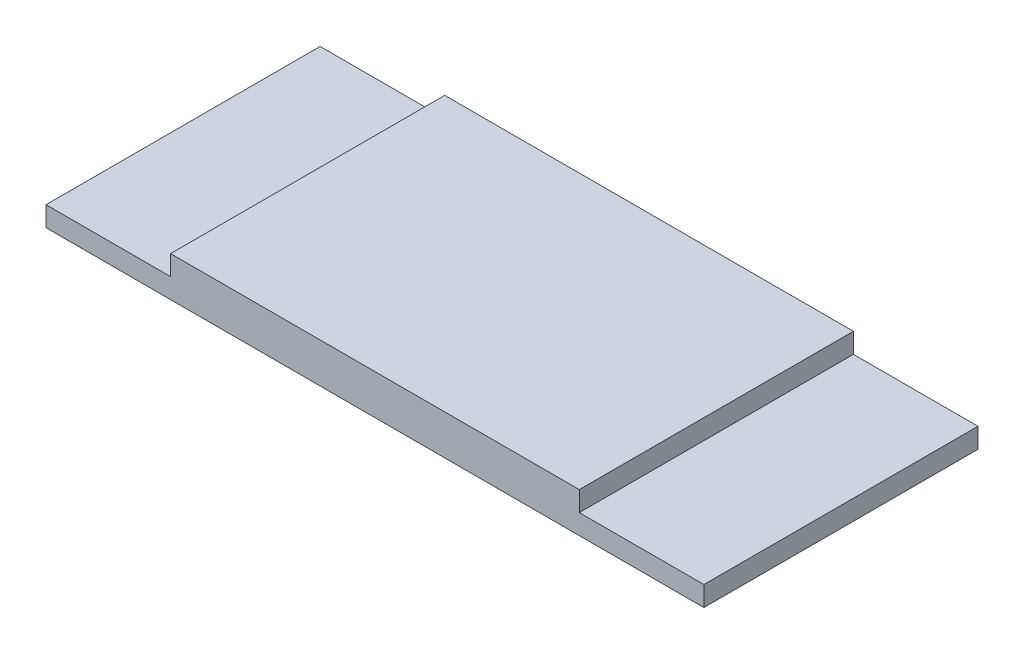
ISO-10303-21;
HEADER;
FILE_DESCRIPTION(('STEP AP214'),'2;1');
FILE_NAME('part.step','',(''),(''),'','','');
FILE_SCHEMA(('AUTOMOTIVE_DESIGN { 1 0 10303 214 1 1 1 1 }'));
ENDSEC;
DATA;
#1=APPLICATION_CONTEXT('core data for automotive mechanical design processes');
#2=APPLICATION_PROTOCOL_DEFINITION('international standard','automotive_design',2000,#1);
#3=PRODUCT_CONTEXT('',#1,'mechanical');
#4=PRODUCT('Part','Part','',(#3));
#5=PRODUCT_RELATED_PRODUCT_CATEGORY('part','',(#4));
#6=PRODUCT_DEFINITION_FORMATION('','',#4);
#7=PRODUCT_DEFINITION_CONTEXT('part definition',#1,'design');
#8=PRODUCT_DEFINITION('design','',#6,#7);
#9=PRODUCT_DEFINITION_SHAPE('','',#8);
#10=(LENGTH_UNIT() NAMED_UNIT(*) SI_UNIT(.MILLI.,.METRE.));
#11=(NAMED_UNIT(*) PLANE_ANGLE_UNIT() SI_UNIT($,.RADIAN.));
#12=(NAMED_UNIT(*) SI_UNIT($,.STERADIAN.) SOLID_ANGLE_UNIT());
#13=UNCERTAINTY_MEASURE_WITH_UNIT(LENGTH_MEASURE(1.E-05),#10,'distance_accuracy_value','');
#14=(GEOMETRIC_REPRESENTATION_CONTEXT(3) GLOBAL_UNCERTAINTY_ASSIGNED_CONTEXT((#13)) GLOBAL_UNIT_ASSIGNED_CONTEXT((#10,
#11,#12)) REPRESENTATION_CONTEXT('',''));
#15=CARTESIAN_POINT('',(0.,0.,0.));
#16=DIRECTION('',(0.,0.,1.));
#17=DIRECTION('',(1.,0.,0.));
#18=AXIS2_PLACEMENT_3D('',#15,#16,#17);
#19=CARTESIAN_POINT('',(-8.19999999999015,0.8,5.50000000000899));
#20=DIRECTION('',(1.,0.,-1.91450390893906E-13));
#21=DIRECTION('',(-1.91450390893906E-13,0.,-1.));
#22=AXIS2_PLACEMENT_3D('',#19,#20,#21);
#23=PLANE('',#22);
#24=DIRECTION('',(1.91450390893906E-13,0.,1.));
#25=VECTOR('',#24,1.);
#26=CARTESIAN_POINT('',(-8.19999999999015,0.,5.50000000000899));
#27=LINE('',#26,#25);
#28=CARTESIAN_POINT('',(-8.1999999999912,0.,-5.50000000000904));
#29=VERTEX_POINT('',#28);
#30=CARTESIAN_POINT('',(-8.1999999999912,0.,5.50000000001052));
#31=VERTEX_POINT('',#30);
#32=EDGE_CURVE('E117',#29,#31,#27,.T.);
#33=ORIENTED_EDGE('',*,*,#32,.T.);
#34=DIRECTION('',(0.,-1.,0.));
#35=VECTOR('',#34,1.);
#36=CARTESIAN_POINT('',(-8.19999999999015,0.8,5.50000000000899));
#37=LINE('',#36,#35);
#38=CARTESIAN_POINT('',(-8.19999999999015,0.8,5.50000000000899));
#39=VERTEX_POINT('',#38);
#40=EDGE_CURVE('E11',#39,#31,#37,.T.);
#41=ORIENTED_EDGE('',*,*,#40,.F.);
#42=DIRECTION('',(1.91450390893906E-13,0.,1.));
#43=VECTOR('',#42,1.);
#44=CARTESIAN_POINT('',(-8.19999999999015,0.8,5.50000000000899));
#45=LINE('',#44,#43);
#46=CARTESIAN_POINT('',(-8.19999999999225,0.8,-5.50000000000603));
#47=VERTEX_POINT('',#46);
#48=EDGE_CURVE('E126',#47,#39,#45,.T.);
#49=ORIENTED_EDGE('',*,*,#48,.F.);
#50=DIRECTION('',(0.,-1.,0.));
#51=VECTOR('',#50,1.);
#52=CARTESIAN_POINT('',(-8.19999999999225,0.8,-5.50000000000603));
#53=LINE('',#52,#51);
#54=EDGE_CURVE('E132',#47,#29,#53,.T.);
#55=ORIENTED_EDGE('',*,*,#54,.T.);
#56=EDGE_LOOP('',(#33,#41,#49,#55));
#57=FACE_BOUND('',#56,.T.);
#58=ADVANCED_FACE('F33',(#57),#23,.F.);
#59=CARTESIAN_POINT('',(-8.19999999999015,0.8,5.50000000000899));
#60=DIRECTION('',(-1.80717991384499E-13,0.,-1.));
#61=DIRECTION('',(-1.,0.,1.80717991384499E-13));
#62=AXIS2_PLACEMENT_3D('',#59,#60,#61);
#63=PLANE('',#62);
#64=ORIENTED_EDGE('',*,*,#40,.T.);
#65=DIRECTION('',(-1.,0.,0.));
#66=VECTOR('',#65,1.);
#67=CARTESIAN_POINT('',(-13.1999999999856,0.,5.50000000001052));
#68=LINE('',#67,#66);
#69=CARTESIAN_POINT('',(-13.1999999999856,0.,5.50000000001052));
#70=VERTEX_POINT('',#69);
#71=EDGE_CURVE('E115',#31,#70,#68,.T.);
#72=ORIENTED_EDGE('',*,*,#71,.T.);
#73=DIRECTION('',(0.,1.,0.));
#74=VECTOR('',#73,1.);
#75=CARTESIAN_POINT('',(-13.1999999999856,-0.8,5.50000000001052));
#76=LINE('',#75,#74);
#77=CARTESIAN_POINT('',(-13.1999999999856,-0.8,5.50000000001052));
#78=VERTEX_POINT('',#77);
#79=EDGE_CURVE('E97',#78,#70,#76,.T.);
#80=ORIENTED_EDGE('',*,*,#79,.F.);
#81=DIRECTION('',(-1.,0.,0.));
#82=VECTOR('',#81,1.);
#83=CARTESIAN_POINT('',(-13.1999999999856,-0.8,5.50000000001052));
#84=LINE('',#83,#82);
#85=CARTESIAN_POINT('',(13.2000000000133,-0.8,5.50000000001052));
#86=VERTEX_POINT('',#85);
#87=EDGE_CURVE('E103',#86,#78,#84,.T.);
#88=ORIENTED_EDGE('',*,*,#87,.F.);
#89=DIRECTION('',(0.,1.,0.));
#90=VECTOR('',#89,1.);
#91=CARTESIAN_POINT('',(13.2000000000133,-0.8,5.50000000001052));
#92=LINE('',#91,#90);
#93=CARTESIAN_POINT('',(13.2000000000133,0.,5.50000000001052));
#94=VERTEX_POINT('',#93);
#95=EDGE_CURVE('E149',#86,#94,#92,.T.);
#96=ORIENTED_EDGE('',*,*,#95,.T.);
#97=CARTESIAN_POINT('',(8.20000000001155,0.,5.50000000001052));
#98=VERTEX_POINT('',#97);
#99=EDGE_CURVE('E148',#94,#98,#68,.T.);
#100=ORIENTED_EDGE('',*,*,#99,.T.);
#101=DIRECTION('',(0.,-1.,0.));
#102=VECTOR('',#101,1.);
#103=CARTESIAN_POINT('',(8.20000000001315,0.8,5.50000000000603));
#104=LINE('',#103,#102);
#105=CARTESIAN_POINT('',(8.20000000001315,0.8,5.50000000000603));
#106=VERTEX_POINT('',#105);
#107=EDGE_CURVE('E41',#106,#98,#104,.T.);
#108=ORIENTED_EDGE('',*,*,#107,.F.);
#109=DIRECTION('',(1.,0.,-1.80717991384499E-13));
#110=VECTOR('',#109,1.);
#111=CARTESIAN_POINT('',(-8.19999999999015,0.8,5.50000000000899));
#112=LINE('',#111,#110);
#113=EDGE_CURVE('E128',#39,#106,#112,.T.);
#114=ORIENTED_EDGE('',*,*,#113,.F.);
#115=EDGE_LOOP('',(#64,#72,#80,#88,#96,#100,#108,#114));
#116=FACE_BOUND('',#115,.T.);
#117=ADVANCED_FACE('F114',(#116),#63,.F.);
#118=CARTESIAN_POINT('',(8.20000000001315,0.8,5.50000000000603));
#119=DIRECTION('',(-1.,0.,2.90487331158707E-13));
#120=DIRECTION('',(2.90487331158707E-13,0.,1.));
#121=AXIS2_PLACEMENT_3D('',#118,#119,#120);
#122=PLANE('',#121);
#123=DIRECTION('',(-2.90487331158707E-13,0.,-1.));
#124=VECTOR('',#123,1.);
#125=CARTESIAN_POINT('',(8.20000000001315,0.,5.50000000000603));
#126=LINE('',#125,#124);
#127=CARTESIAN_POINT('',(8.20000000000995,0.,-5.50000000000603));
#128=VERTEX_POINT('',#127);
#129=EDGE_CURVE('E120',#98,#128,#126,.T.);
#130=ORIENTED_EDGE('',*,*,#129,.T.);
#131=DIRECTION('',(0.,-1.,0.));
#132=VECTOR('',#131,1.);
#133=CARTESIAN_POINT('',(8.20000000000995,0.8,-5.50000000000603));
#134=LINE('',#133,#132);
#135=CARTESIAN_POINT('',(8.20000000000995,0.8,-5.50000000000603));
#136=VERTEX_POINT('',#135);
#137=EDGE_CURVE('E138',#136,#128,#134,.T.);
#138=ORIENTED_EDGE('',*,*,#137,.F.);
#139=DIRECTION('',(-2.90487331158707E-13,0.,-1.));
#140=VECTOR('',#139,1.);
#141=CARTESIAN_POINT('',(8.20000000001315,0.8,5.50000000000603));
#142=LINE('',#141,#140);
#143=EDGE_CURVE('E130',#106,#136,#142,.T.);
#144=ORIENTED_EDGE('',*,*,#143,.F.);
#145=ORIENTED_EDGE('',*,*,#107,.T.);
#146=EDGE_LOOP('',(#130,#138,#144,#145));
#147=FACE_BOUND('',#146,.T.);
#148=ADVANCED_FACE('F144',(#147),#122,.F.);
#149=CARTESIAN_POINT('',(-8.19999999999225,0.8,-5.50000000000603));
#150=DIRECTION('',(0.,0.,1.));
#151=DIRECTION('',(1.,0.,0.));
#152=AXIS2_PLACEMENT_3D('',#149,#150,#151);
#153=PLANE('',#152);
#154=ORIENTED_EDGE('',*,*,#137,.T.);
#155=DIRECTION('',(1.,0.,0.));
#156=VECTOR('',#155,1.);
#157=CARTESIAN_POINT('',(-13.1999999999856,0.,-5.50000000000904));
#158=LINE('',#157,#156);
#159=CARTESIAN_POINT('',(13.2000000000133,0.,-5.50000000000904));
#160=VERTEX_POINT('',#159);
#161=EDGE_CURVE('E154',#128,#160,#158,.T.);
#162=ORIENTED_EDGE('',*,*,#161,.T.);
#163=DIRECTION('',(0.,1.,0.));
#164=VECTOR('',#163,1.);
#165=CARTESIAN_POINT('',(13.2000000000133,-0.8,-5.50000000000904));
#166=LINE('',#165,#164);
#167=CARTESIAN_POINT('',(13.2000000000133,-0.8,-5.50000000000904));
#168=VERTEX_POINT('',#167);
#169=EDGE_CURVE('E122',#168,#160,#166,.T.);
#170=ORIENTED_EDGE('',*,*,#169,.F.);
#171=DIRECTION('',(1.,0.,0.));
#172=VECTOR('',#171,1.);
#173=CARTESIAN_POINT('',(-13.1999999999856,-0.8,-5.50000000000904));
#174=LINE('',#173,#172);
#175=CARTESIAN_POINT('',(-13.1999999999856,-0.8,-5.50000000000904));
#176=VERTEX_POINT('',#175);
#177=EDGE_CURVE('E102',#176,#168,#174,.T.);
#178=ORIENTED_EDGE('',*,*,#177,.F.);
#179=DIRECTION('',(0.,1.,0.));
#180=VECTOR('',#179,1.);
#181=CARTESIAN_POINT('',(-13.1999999999856,-0.8,-5.50000000000904));
#182=LINE('',#181,#180);
#183=CARTESIAN_POINT('',(-13.1999999999856,0.,-5.50000000000904));
#184=VERTEX_POINT('',#183);
#185=EDGE_CURVE('E99',#176,#184,#182,.T.);
#186=ORIENTED_EDGE('',*,*,#185,.T.);
#187=EDGE_CURVE('E159',#184,#29,#158,.T.);
#188=ORIENTED_EDGE('',*,*,#187,.T.);
#189=ORIENTED_EDGE('',*,*,#54,.F.);
#190=DIRECTION('',(-1.,0.,0.));
#191=VECTOR('',#190,1.);
#192=CARTESIAN_POINT('',(-8.19999999999225,0.8,-5.50000000000603));
#193=LINE('',#192,#191);
#194=EDGE_CURVE('E48',#136,#47,#193,.T.);
#195=ORIENTED_EDGE('',*,*,#194,.F.);
#196=EDGE_LOOP('',(#154,#162,#170,#178,#186,#188,#189,#195));
#197=FACE_BOUND('',#196,.T.);
#198=ADVANCED_FACE('F170',(#197),#153,.F.);
#199=CARTESIAN_POINT('',(0.,0.8,0.));
#200=DIRECTION('',(0.,-1.,0.));
#201=DIRECTION('',(0.,0.,-1.));
#202=AXIS2_PLACEMENT_3D('',#199,#200,#201);
#203=PLANE('',#202);
#204=ORIENTED_EDGE('',*,*,#48,.T.);
#205=ORIENTED_EDGE('',*,*,#113,.T.);
#206=ORIENTED_EDGE('',*,*,#143,.T.);
#207=ORIENTED_EDGE('',*,*,#194,.T.);
#208=EDGE_LOOP('',(#204,#205,#206,#207));
#209=FACE_BOUND('',#208,.T.);
#210=ADVANCED_FACE('F175',(#209),#203,.F.);
#211=CARTESIAN_POINT('',(0.,0.,0.));
#212=DIRECTION('',(0.,-1.,0.));
#213=DIRECTION('',(0.,0.,-1.));
#214=AXIS2_PLACEMENT_3D('',#211,#212,#213);
#215=PLANE('',#214);
#216=ORIENTED_EDGE('',*,*,#32,.F.);
#217=ORIENTED_EDGE('',*,*,#187,.F.);
#218=DIRECTION('',(0.,0.,-1.));
#219=VECTOR('',#218,1.);
#220=CARTESIAN_POINT('',(-13.1999999999856,0.,-5.50000000000904));
#221=LINE('',#220,#219);
#222=EDGE_CURVE('E152',#70,#184,#221,.T.);
#223=ORIENTED_EDGE('',*,*,#222,.F.);
#224=ORIENTED_EDGE('',*,*,#71,.F.);
#225=EDGE_LOOP('',(#216,#217,#223,#224));
#226=FACE_BOUND('',#225,.T.);
#227=ADVANCED_FACE('F177',(#226),#215,.F.);
#228=CARTESIAN_POINT('',(-13.1999999999856,-0.8,-5.50000000000904));
#229=DIRECTION('',(1.,0.,0.));
#230=DIRECTION('',(0.,0.,-1.));
#231=AXIS2_PLACEMENT_3D('',#228,#229,#230);
#232=PLANE('',#231);
#233=ORIENTED_EDGE('',*,*,#222,.T.);
#234=ORIENTED_EDGE('',*,*,#185,.F.);
#235=DIRECTION('',(0.,0.,-1.));
#236=VECTOR('',#235,1.);
#237=CARTESIAN_POINT('',(-13.1999999999856,-0.8,-5.50000000000904));
#238=LINE('',#237,#236);
#239=EDGE_CURVE('E93',#78,#176,#238,.T.);
#240=ORIENTED_EDGE('',*,*,#239,.F.);
#241=ORIENTED_EDGE('',*,*,#79,.T.);
#242=EDGE_LOOP('',(#233,#234,#240,#241));
#243=FACE_BOUND('',#242,.T.);
#244=ADVANCED_FACE('F95',(#243),#232,.F.);
#245=CARTESIAN_POINT('',(13.2000000000133,-0.8,-5.50000000000904));
#246=DIRECTION('',(-1.,0.,0.));
#247=DIRECTION('',(0.,0.,1.));
#248=AXIS2_PLACEMENT_3D('',#245,#246,#247);
#249=PLANE('',#248);
#250=DIRECTION('',(0.,0.,1.));
#251=VECTOR('',#250,1.);
#252=CARTESIAN_POINT('',(13.2000000000133,0.,-5.50000000000904));
#253=LINE('',#252,#251);
#254=EDGE_CURVE('E112',#160,#94,#253,.T.);
#255=ORIENTED_EDGE('',*,*,#254,.T.);
#256=ORIENTED_EDGE('',*,*,#95,.F.);
#257=DIRECTION('',(0.,0.,1.));
#258=VECTOR('',#257,1.);
#259=CARTESIAN_POINT('',(13.2000000000133,-0.8,-5.50000000000904));
#260=LINE('',#259,#258);
#261=EDGE_CURVE('E108',#168,#86,#260,.T.);
#262=ORIENTED_EDGE('',*,*,#261,.F.);
#263=ORIENTED_EDGE('',*,*,#169,.T.);
#264=EDGE_LOOP('',(#255,#256,#262,#263));
#265=FACE_BOUND('',#264,.T.);
#266=ADVANCED_FACE('F166',(#265),#249,.F.);
#267=CARTESIAN_POINT('',(0.,-0.8,0.));
#268=DIRECTION('',(0.,-1.,0.));
#269=DIRECTION('',(0.,0.,-1.));
#270=AXIS2_PLACEMENT_3D('',#267,#268,#269);
#271=PLANE('',#270);
#272=ORIENTED_EDGE('',*,*,#87,.T.);
#273=ORIENTED_EDGE('',*,*,#239,.T.);
#274=ORIENTED_EDGE('',*,*,#177,.T.);
#275=ORIENTED_EDGE('',*,*,#261,.T.);
#276=EDGE_LOOP('',(#272,#273,#274,#275));
#277=FACE_BOUND('',#276,.T.);
#278=ADVANCED_FACE('F106',(#277),#271,.T.);
#279=ORIENTED_EDGE('',*,*,#129,.F.);
#280=ORIENTED_EDGE('',*,*,#99,.F.);
#281=ORIENTED_EDGE('',*,*,#254,.F.);
#282=ORIENTED_EDGE('',*,*,#161,.F.);
#283=EDGE_LOOP('',(#279,#280,#281,#282));
#284=FACE_BOUND('',#283,.T.);
#285=ADVANCED_FACE('F169',(#284),#215,.F.);
#286=CLOSED_SHELL('',(#58,#117,#148,#198,#210,#227,#244,#266,#278,#285));
#287=MANIFOLD_SOLID_BREP('B2',#286);
#288=ADVANCED_BREP_SHAPE_REPRESENTATION('',(#18,#287),#14);
#289=SHAPE_DEFINITION_REPRESENTATION(#9,#288);
ENDSEC;
END-ISO-10303-21;
